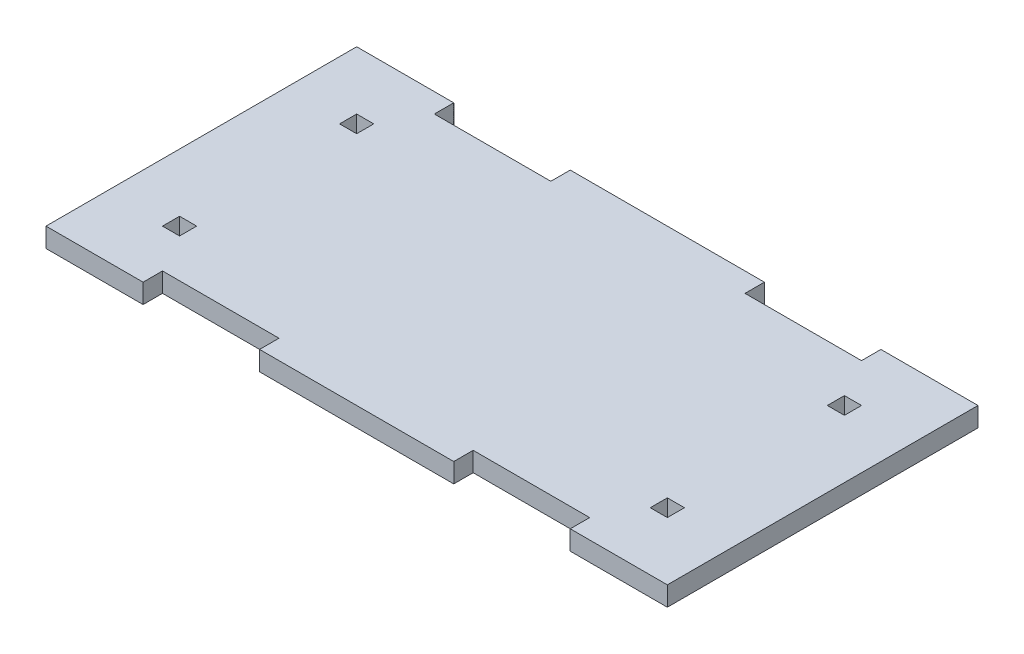
ISO-10303-21;
HEADER;
FILE_DESCRIPTION(('STEP AP214'),'2;1');
FILE_NAME('part.step','',(''),(''),'','','');
FILE_SCHEMA(('AUTOMOTIVE_DESIGN { 1 0 10303 214 1 1 1 1 }'));
ENDSEC;
DATA;
#1=APPLICATION_CONTEXT('core data for automotive mechanical design processes');
#2=APPLICATION_PROTOCOL_DEFINITION('international standard','automotive_design',2000,#1);
#3=PRODUCT_CONTEXT('',#1,'mechanical');
#4=PRODUCT('Part','Part','',(#3));
#5=PRODUCT_RELATED_PRODUCT_CATEGORY('part','',(#4));
#6=PRODUCT_DEFINITION_FORMATION('','',#4);
#7=PRODUCT_DEFINITION_CONTEXT('part definition',#1,'design');
#8=PRODUCT_DEFINITION('design','',#6,#7);
#9=PRODUCT_DEFINITION_SHAPE('','',#8);
#10=(LENGTH_UNIT() NAMED_UNIT(*) SI_UNIT(.MILLI.,.METRE.));
#11=(NAMED_UNIT(*) PLANE_ANGLE_UNIT() SI_UNIT($,.RADIAN.));
#12=(NAMED_UNIT(*) SI_UNIT($,.STERADIAN.) SOLID_ANGLE_UNIT());
#13=UNCERTAINTY_MEASURE_WITH_UNIT(LENGTH_MEASURE(1.E-05),#10,'distance_accuracy_value','');
#14=(GEOMETRIC_REPRESENTATION_CONTEXT(3) GLOBAL_UNCERTAINTY_ASSIGNED_CONTEXT((#13)) GLOBAL_UNIT_ASSIGNED_CONTEXT((#10,
#11,#12)) REPRESENTATION_CONTEXT('',''));
#15=CARTESIAN_POINT('',(0.,0.,0.));
#16=DIRECTION('',(0.,0.,1.));
#17=DIRECTION('',(1.,0.,0.));
#18=AXIS2_PLACEMENT_3D('',#15,#16,#17);
#19=CARTESIAN_POINT('',(0.,6.35,31.75));
#20=DIRECTION('',(0.,0.,1.));
#21=DIRECTION('',(1.,0.,0.));
#22=AXIS2_PLACEMENT_3D('',#19,#20,#21);
#23=PLANE('',#22);
#24=DIRECTION('',(-1.,0.,0.));
#25=VECTOR('',#24,1.);
#26=CARTESIAN_POINT('',(0.,0.,31.75));
#27=LINE('',#26,#25);
#28=CARTESIAN_POINT('',(82.55,0.,31.75));
#29=VERTEX_POINT('',#28);
#30=CARTESIAN_POINT('',(76.962,0.,31.75));
#31=VERTEX_POINT('',#30);
#32=EDGE_CURVE('E382',#29,#31,#27,.T.);
#33=ORIENTED_EDGE('',*,*,#32,.T.);
#34=DIRECTION('',(0.,-1.,0.));
#35=VECTOR('',#34,1.);
#36=CARTESIAN_POINT('',(76.962,6.35,31.75));
#37=LINE('',#36,#35);
#38=CARTESIAN_POINT('',(76.962,6.35,31.75));
#39=VERTEX_POINT('',#38);
#40=EDGE_CURVE('E11',#39,#31,#37,.T.);
#41=ORIENTED_EDGE('',*,*,#40,.F.);
#42=DIRECTION('',(-1.,0.,0.));
#43=VECTOR('',#42,1.);
#44=CARTESIAN_POINT('',(0.,6.35,31.75));
#45=LINE('',#44,#43);
#46=CARTESIAN_POINT('',(82.55,6.35,31.75));
#47=VERTEX_POINT('',#46);
#48=EDGE_CURVE('E282',#47,#39,#45,.T.);
#49=ORIENTED_EDGE('',*,*,#48,.F.);
#50=DIRECTION('',(0.,-1.,0.));
#51=VECTOR('',#50,1.);
#52=CARTESIAN_POINT('',(82.55,6.35,31.75));
#53=LINE('',#52,#51);
#54=EDGE_CURVE('E54',#47,#29,#53,.T.);
#55=ORIENTED_EDGE('',*,*,#54,.T.);
#56=EDGE_LOOP('',(#33,#41,#49,#55));
#57=FACE_BOUND('',#56,.T.);
#58=ADVANCED_FACE('F35',(#57),#23,.F.);
#59=CARTESIAN_POINT('',(76.962,6.35,0.));
#60=DIRECTION('',(-1.,0.,0.));
#61=DIRECTION('',(0.,0.,1.));
#62=AXIS2_PLACEMENT_3D('',#59,#60,#61);
#63=PLANE('',#62);
#64=DIRECTION('',(0.,0.,-1.));
#65=VECTOR('',#64,1.);
#66=CARTESIAN_POINT('',(76.962,0.,0.));
#67=LINE('',#66,#65);
#68=CARTESIAN_POINT('',(76.962,0.,26.162));
#69=VERTEX_POINT('',#68);
#70=EDGE_CURVE('E288',#31,#69,#67,.T.);
#71=ORIENTED_EDGE('',*,*,#70,.T.);
#72=DIRECTION('',(0.,-1.,0.));
#73=VECTOR('',#72,1.);
#74=CARTESIAN_POINT('',(76.962,6.35,26.162));
#75=LINE('',#74,#73);
#76=CARTESIAN_POINT('',(76.962,6.35,26.162));
#77=VERTEX_POINT('',#76);
#78=EDGE_CURVE('E45',#77,#69,#75,.T.);
#79=ORIENTED_EDGE('',*,*,#78,.F.);
#80=DIRECTION('',(0.,0.,-1.));
#81=VECTOR('',#80,1.);
#82=CARTESIAN_POINT('',(76.962,6.35,0.));
#83=LINE('',#82,#81);
#84=EDGE_CURVE('E276',#39,#77,#83,.T.);
#85=ORIENTED_EDGE('',*,*,#84,.F.);
#86=ORIENTED_EDGE('',*,*,#40,.T.);
#87=EDGE_LOOP('',(#71,#79,#85,#86));
#88=FACE_BOUND('',#87,.T.);
#89=ADVANCED_FACE('F287',(#88),#63,.F.);
#90=CARTESIAN_POINT('',(0.,6.35,26.162));
#91=DIRECTION('',(0.,0.,1.));
#92=DIRECTION('',(1.,0.,0.));
#93=AXIS2_PLACEMENT_3D('',#90,#91,#92);
#94=PLANE('',#93);
#95=DIRECTION('',(-1.,0.,0.));
#96=VECTOR('',#95,1.);
#97=CARTESIAN_POINT('',(0.,0.,26.162));
#98=LINE('',#97,#96);
#99=CARTESIAN_POINT('',(82.55,0.,26.162));
#100=VERTEX_POINT('',#99);
#101=EDGE_CURVE('E385',#100,#69,#98,.T.);
#102=ORIENTED_EDGE('',*,*,#101,.F.);
#103=DIRECTION('',(0.,-1.,0.));
#104=VECTOR('',#103,1.);
#105=CARTESIAN_POINT('',(82.55,6.35,26.162));
#106=LINE('',#105,#104);
#107=CARTESIAN_POINT('',(82.55,6.35,26.162));
#108=VERTEX_POINT('',#107);
#109=EDGE_CURVE('E164',#108,#100,#106,.T.);
#110=ORIENTED_EDGE('',*,*,#109,.F.);
#111=DIRECTION('',(-1.,0.,0.));
#112=VECTOR('',#111,1.);
#113=CARTESIAN_POINT('',(0.,6.35,26.162));
#114=LINE('',#113,#112);
#115=EDGE_CURVE('E281',#108,#77,#114,.T.);
#116=ORIENTED_EDGE('',*,*,#115,.T.);
#117=ORIENTED_EDGE('',*,*,#78,.T.);
#118=EDGE_LOOP('',(#102,#110,#116,#117));
#119=FACE_BOUND('',#118,.T.);
#120=ADVANCED_FACE('F292',(#119),#94,.T.);
#121=CARTESIAN_POINT('',(0.,6.35,-31.75));
#122=DIRECTION('',(0.,0.,-1.));
#123=DIRECTION('',(-1.,0.,0.));
#124=AXIS2_PLACEMENT_3D('',#121,#122,#123);
#125=PLANE('',#124);
#126=DIRECTION('',(1.,0.,0.));
#127=VECTOR('',#126,1.);
#128=CARTESIAN_POINT('',(0.,0.,-31.75));
#129=LINE('',#128,#127);
#130=CARTESIAN_POINT('',(76.962,0.,-31.75));
#131=VERTEX_POINT('',#130);
#132=CARTESIAN_POINT('',(82.55,0.,-31.75));
#133=VERTEX_POINT('',#132);
#134=EDGE_CURVE('E370',#131,#133,#129,.T.);
#135=ORIENTED_EDGE('',*,*,#134,.T.);
#136=DIRECTION('',(0.,-1.,0.));
#137=VECTOR('',#136,1.);
#138=CARTESIAN_POINT('',(82.55,6.35,-31.75));
#139=LINE('',#138,#137);
#140=CARTESIAN_POINT('',(82.55,6.35,-31.75));
#141=VERTEX_POINT('',#140);
#142=EDGE_CURVE('E392',#141,#133,#139,.T.);
#143=ORIENTED_EDGE('',*,*,#142,.F.);
#144=DIRECTION('',(1.,0.,0.));
#145=VECTOR('',#144,1.);
#146=CARTESIAN_POINT('',(0.,6.35,-31.75));
#147=LINE('',#146,#145);
#148=CARTESIAN_POINT('',(76.962,6.35,-31.75));
#149=VERTEX_POINT('',#148);
#150=EDGE_CURVE('E547',#149,#141,#147,.T.);
#151=ORIENTED_EDGE('',*,*,#150,.F.);
#152=DIRECTION('',(0.,-1.,0.));
#153=VECTOR('',#152,1.);
#154=CARTESIAN_POINT('',(76.962,6.35,-31.75));
#155=LINE('',#154,#153);
#156=EDGE_CURVE('E394',#149,#131,#155,.T.);
#157=ORIENTED_EDGE('',*,*,#156,.T.);
#158=EDGE_LOOP('',(#135,#143,#151,#157));
#159=FACE_BOUND('',#158,.T.);
#160=ADVANCED_FACE('F573',(#159),#125,.F.);
#161=CARTESIAN_POINT('',(82.55,6.35,0.));
#162=DIRECTION('',(1.,0.,0.));
#163=DIRECTION('',(0.,0.,-1.));
#164=AXIS2_PLACEMENT_3D('',#161,#162,#163);
#165=PLANE('',#164);
#166=DIRECTION('',(0.,0.,1.));
#167=VECTOR('',#166,1.);
#168=CARTESIAN_POINT('',(82.55,0.,0.));
#169=LINE('',#168,#167);
#170=CARTESIAN_POINT('',(82.55,0.,-26.162));
#171=VERTEX_POINT('',#170);
#172=EDGE_CURVE('E373',#133,#171,#169,.T.);
#173=ORIENTED_EDGE('',*,*,#172,.T.);
#174=DIRECTION('',(0.,-1.,0.));
#175=VECTOR('',#174,1.);
#176=CARTESIAN_POINT('',(82.55,6.35,-26.162));
#177=LINE('',#176,#175);
#178=CARTESIAN_POINT('',(82.55,6.35,-26.162));
#179=VERTEX_POINT('',#178);
#180=EDGE_CURVE('E399',#179,#171,#177,.T.);
#181=ORIENTED_EDGE('',*,*,#180,.F.);
#182=DIRECTION('',(0.,0.,1.));
#183=VECTOR('',#182,1.);
#184=CARTESIAN_POINT('',(82.55,6.35,0.));
#185=LINE('',#184,#183);
#186=EDGE_CURVE('E550',#141,#179,#185,.T.);
#187=ORIENTED_EDGE('',*,*,#186,.F.);
#188=ORIENTED_EDGE('',*,*,#142,.T.);
#189=EDGE_LOOP('',(#173,#181,#187,#188));
#190=FACE_BOUND('',#189,.T.);
#191=ADVANCED_FACE('F575',(#190),#165,.F.);
#192=CARTESIAN_POINT('',(0.,6.35,-26.162));
#193=DIRECTION('',(0.,0.,-1.));
#194=DIRECTION('',(-1.,0.,0.));
#195=AXIS2_PLACEMENT_3D('',#192,#193,#194);
#196=PLANE('',#195);
#197=DIRECTION('',(1.,0.,0.));
#198=VECTOR('',#197,1.);
#199=CARTESIAN_POINT('',(0.,0.,-26.162));
#200=LINE('',#199,#198);
#201=CARTESIAN_POINT('',(76.962,0.,-26.162));
#202=VERTEX_POINT('',#201);
#203=EDGE_CURVE('E376',#202,#171,#200,.T.);
#204=ORIENTED_EDGE('',*,*,#203,.F.);
#205=DIRECTION('',(0.,-1.,0.));
#206=VECTOR('',#205,1.);
#207=CARTESIAN_POINT('',(76.962,6.35,-26.162));
#208=LINE('',#207,#206);
#209=CARTESIAN_POINT('',(76.962,6.35,-26.162));
#210=VERTEX_POINT('',#209);
#211=EDGE_CURVE('E396',#210,#202,#208,.T.);
#212=ORIENTED_EDGE('',*,*,#211,.F.);
#213=DIRECTION('',(1.,0.,0.));
#214=VECTOR('',#213,1.);
#215=CARTESIAN_POINT('',(0.,6.35,-26.162));
#216=LINE('',#215,#214);
#217=EDGE_CURVE('E552',#210,#179,#216,.T.);
#218=ORIENTED_EDGE('',*,*,#217,.T.);
#219=ORIENTED_EDGE('',*,*,#180,.T.);
#220=EDGE_LOOP('',(#204,#212,#218,#219));
#221=FACE_BOUND('',#220,.T.);
#222=ADVANCED_FACE('F568',(#221),#196,.T.);
#223=CARTESIAN_POINT('',(0.,6.35,-31.75));
#224=DIRECTION('',(0.,0.,-1.));
#225=DIRECTION('',(-1.,0.,0.));
#226=AXIS2_PLACEMENT_3D('',#223,#224,#225);
#227=PLANE('',#226);
#228=DIRECTION('',(1.,0.,0.));
#229=VECTOR('',#228,1.);
#230=CARTESIAN_POINT('',(0.,0.,-31.75));
#231=LINE('',#230,#229);
#232=CARTESIAN_POINT('',(-82.55,0.,-31.75));
#233=VERTEX_POINT('',#232);
#234=CARTESIAN_POINT('',(-76.962,0.,-31.75));
#235=VERTEX_POINT('',#234);
#236=EDGE_CURVE('E358',#233,#235,#231,.T.);
#237=ORIENTED_EDGE('',*,*,#236,.T.);
#238=DIRECTION('',(0.,-1.,0.));
#239=VECTOR('',#238,1.);
#240=CARTESIAN_POINT('',(-76.962,6.35,-31.75));
#241=LINE('',#240,#239);
#242=CARTESIAN_POINT('',(-76.962,6.35,-31.75));
#243=VERTEX_POINT('',#242);
#244=EDGE_CURVE('E397',#243,#235,#241,.T.);
#245=ORIENTED_EDGE('',*,*,#244,.F.);
#246=DIRECTION('',(1.,0.,0.));
#247=VECTOR('',#246,1.);
#248=CARTESIAN_POINT('',(0.,6.35,-31.75));
#249=LINE('',#248,#247);
#250=CARTESIAN_POINT('',(-82.55,6.35,-31.75));
#251=VERTEX_POINT('',#250);
#252=EDGE_CURVE('E536',#251,#243,#249,.T.);
#253=ORIENTED_EDGE('',*,*,#252,.F.);
#254=DIRECTION('',(0.,-1.,0.));
#255=VECTOR('',#254,1.);
#256=CARTESIAN_POINT('',(-82.55,6.35,-31.75));
#257=LINE('',#256,#255);
#258=EDGE_CURVE('E403',#251,#233,#257,.T.);
#259=ORIENTED_EDGE('',*,*,#258,.T.);
#260=EDGE_LOOP('',(#237,#245,#253,#259));
#261=FACE_BOUND('',#260,.T.);
#262=ADVANCED_FACE('F582',(#261),#227,.F.);
#263=CARTESIAN_POINT('',(-76.962,6.35,0.));
#264=DIRECTION('',(1.,0.,0.));
#265=DIRECTION('',(0.,0.,-1.));
#266=AXIS2_PLACEMENT_3D('',#263,#264,#265);
#267=PLANE('',#266);
#268=DIRECTION('',(0.,0.,1.));
#269=VECTOR('',#268,1.);
#270=CARTESIAN_POINT('',(-76.962,0.,0.));
#271=LINE('',#270,#269);
#272=CARTESIAN_POINT('',(-76.962,0.,-26.162));
#273=VERTEX_POINT('',#272);
#274=EDGE_CURVE('E361',#235,#273,#271,.T.);
#275=ORIENTED_EDGE('',*,*,#274,.T.);
#276=DIRECTION('',(0.,-1.,0.));
#277=VECTOR('',#276,1.);
#278=CARTESIAN_POINT('',(-76.962,6.35,-26.162));
#279=LINE('',#278,#277);
#280=CARTESIAN_POINT('',(-76.962,6.35,-26.162));
#281=VERTEX_POINT('',#280);
#282=EDGE_CURVE('E408',#281,#273,#279,.T.);
#283=ORIENTED_EDGE('',*,*,#282,.F.);
#284=DIRECTION('',(0.,0.,1.));
#285=VECTOR('',#284,1.);
#286=CARTESIAN_POINT('',(-76.962,6.35,0.));
#287=LINE('',#286,#285);
#288=EDGE_CURVE('E539',#243,#281,#287,.T.);
#289=ORIENTED_EDGE('',*,*,#288,.F.);
#290=ORIENTED_EDGE('',*,*,#244,.T.);
#291=EDGE_LOOP('',(#275,#283,#289,#290));
#292=FACE_BOUND('',#291,.T.);
#293=ADVANCED_FACE('F856',(#292),#267,.F.);
#294=CARTESIAN_POINT('',(0.,6.35,-26.162));
#295=DIRECTION('',(0.,0.,-1.));
#296=DIRECTION('',(-1.,0.,0.));
#297=AXIS2_PLACEMENT_3D('',#294,#295,#296);
#298=PLANE('',#297);
#299=DIRECTION('',(1.,0.,0.));
#300=VECTOR('',#299,1.);
#301=CARTESIAN_POINT('',(0.,0.,-26.162));
#302=LINE('',#301,#300);
#303=CARTESIAN_POINT('',(-82.55,0.,-26.162));
#304=VERTEX_POINT('',#303);
#305=EDGE_CURVE('E364',#304,#273,#302,.T.);
#306=ORIENTED_EDGE('',*,*,#305,.F.);
#307=DIRECTION('',(0.,-1.,0.));
#308=VECTOR('',#307,1.);
#309=CARTESIAN_POINT('',(-82.55,6.35,-26.162));
#310=LINE('',#309,#308);
#311=CARTESIAN_POINT('',(-82.55,6.35,-26.162));
#312=VERTEX_POINT('',#311);
#313=EDGE_CURVE('E405',#312,#304,#310,.T.);
#314=ORIENTED_EDGE('',*,*,#313,.F.);
#315=DIRECTION('',(1.,0.,0.));
#316=VECTOR('',#315,1.);
#317=CARTESIAN_POINT('',(0.,6.35,-26.162));
#318=LINE('',#317,#316);
#319=EDGE_CURVE('E541',#312,#281,#318,.T.);
#320=ORIENTED_EDGE('',*,*,#319,.T.);
#321=ORIENTED_EDGE('',*,*,#282,.T.);
#322=EDGE_LOOP('',(#306,#314,#320,#321));
#323=FACE_BOUND('',#322,.T.);
#324=ADVANCED_FACE('F866',(#323),#298,.T.);
#325=CARTESIAN_POINT('',(0.,6.35,26.162));
#326=DIRECTION('',(0.,0.,-1.));
#327=DIRECTION('',(-1.,0.,0.));
#328=AXIS2_PLACEMENT_3D('',#325,#326,#327);
#329=PLANE('',#328);
#330=DIRECTION('',(1.,0.,0.));
#331=VECTOR('',#330,1.);
#332=CARTESIAN_POINT('',(0.,0.,26.162));
#333=LINE('',#332,#331);
#334=CARTESIAN_POINT('',(-82.55,0.,26.162));
#335=VERTEX_POINT('',#334);
#336=CARTESIAN_POINT('',(-76.962,0.,26.162));
#337=VERTEX_POINT('',#336);
#338=EDGE_CURVE('E346',#335,#337,#333,.T.);
#339=ORIENTED_EDGE('',*,*,#338,.T.);
#340=DIRECTION('',(0.,-1.,0.));
#341=VECTOR('',#340,1.);
#342=CARTESIAN_POINT('',(-76.962,6.35,26.162));
#343=LINE('',#342,#341);
#344=CARTESIAN_POINT('',(-76.962,6.35,26.162));
#345=VERTEX_POINT('',#344);
#346=EDGE_CURVE('E406',#345,#337,#343,.T.);
#347=ORIENTED_EDGE('',*,*,#346,.F.);
#348=DIRECTION('',(1.,0.,0.));
#349=VECTOR('',#348,1.);
#350=CARTESIAN_POINT('',(0.,6.35,26.162));
#351=LINE('',#350,#349);
#352=CARTESIAN_POINT('',(-82.55,6.35,26.162));
#353=VERTEX_POINT('',#352);
#354=EDGE_CURVE('E525',#353,#345,#351,.T.);
#355=ORIENTED_EDGE('',*,*,#354,.F.);
#356=DIRECTION('',(0.,-1.,0.));
#357=VECTOR('',#356,1.);
#358=CARTESIAN_POINT('',(-82.55,6.35,26.162));
#359=LINE('',#358,#357);
#360=EDGE_CURVE('E412',#353,#335,#359,.T.);
#361=ORIENTED_EDGE('',*,*,#360,.T.);
#362=EDGE_LOOP('',(#339,#347,#355,#361));
#363=FACE_BOUND('',#362,.T.);
#364=ADVANCED_FACE('F876',(#363),#329,.F.);
#365=CARTESIAN_POINT('',(-76.9620000000001,6.35,1.91134986625808E-13));
#366=DIRECTION('',(1.,0.,0.));
#367=DIRECTION('',(0.,0.,-1.));
#368=AXIS2_PLACEMENT_3D('',#365,#366,#367);
#369=PLANE('',#368);
#370=DIRECTION('',(0.,0.,1.));
#371=VECTOR('',#370,1.);
#372=CARTESIAN_POINT('',(-76.9620000000001,0.,1.91134986625808E-13));
#373=LINE('',#372,#371);
#374=CARTESIAN_POINT('',(-76.962,0.,31.75));
#375=VERTEX_POINT('',#374);
#376=EDGE_CURVE('E349',#337,#375,#373,.T.);
#377=ORIENTED_EDGE('',*,*,#376,.T.);
#378=DIRECTION('',(0.,-1.,0.));
#379=VECTOR('',#378,1.);
#380=CARTESIAN_POINT('',(-76.962,6.35,31.75));
#381=LINE('',#380,#379);
#382=CARTESIAN_POINT('',(-76.962,6.35,31.75));
#383=VERTEX_POINT('',#382);
#384=EDGE_CURVE('E416',#383,#375,#381,.T.);
#385=ORIENTED_EDGE('',*,*,#384,.F.);
#386=DIRECTION('',(0.,0.,1.));
#387=VECTOR('',#386,1.);
#388=CARTESIAN_POINT('',(-76.9620000000001,6.35,1.91134986625808E-13));
#389=LINE('',#388,#387);
#390=EDGE_CURVE('E528',#345,#383,#389,.T.);
#391=ORIENTED_EDGE('',*,*,#390,.F.);
#392=ORIENTED_EDGE('',*,*,#346,.T.);
#393=EDGE_LOOP('',(#377,#385,#391,#392));
#394=FACE_BOUND('',#393,.T.);
#395=ADVANCED_FACE('F886',(#394),#369,.F.);
#396=CARTESIAN_POINT('',(0.,6.35,31.75));
#397=DIRECTION('',(0.,0.,-1.));
#398=DIRECTION('',(-1.,0.,0.));
#399=AXIS2_PLACEMENT_3D('',#396,#397,#398);
#400=PLANE('',#399);
#401=DIRECTION('',(1.,0.,0.));
#402=VECTOR('',#401,1.);
#403=CARTESIAN_POINT('',(0.,0.,31.75));
#404=LINE('',#403,#402);
#405=CARTESIAN_POINT('',(-82.55,0.,31.75));
#406=VERTEX_POINT('',#405);
#407=EDGE_CURVE('E352',#406,#375,#404,.T.);
#408=ORIENTED_EDGE('',*,*,#407,.F.);
#409=DIRECTION('',(0.,-1.,0.));
#410=VECTOR('',#409,1.);
#411=CARTESIAN_POINT('',(-82.55,6.35,31.75));
#412=LINE('',#411,#410);
#413=CARTESIAN_POINT('',(-82.55,6.35,31.75));
#414=VERTEX_POINT('',#413);
#415=EDGE_CURVE('E414',#414,#406,#412,.T.);
#416=ORIENTED_EDGE('',*,*,#415,.F.);
#417=DIRECTION('',(1.,0.,0.));
#418=VECTOR('',#417,1.);
#419=CARTESIAN_POINT('',(0.,6.35,31.75));
#420=LINE('',#419,#418);
#421=EDGE_CURVE('E530',#414,#383,#420,.T.);
#422=ORIENTED_EDGE('',*,*,#421,.T.);
#423=ORIENTED_EDGE('',*,*,#384,.T.);
#424=EDGE_LOOP('',(#408,#416,#422,#423));
#425=FACE_BOUND('',#424,.T.);
#426=ADVANCED_FACE('F668',(#425),#400,.T.);
#427=CARTESIAN_POINT('',(-69.85,6.35,0.));
#428=DIRECTION('',(1.,0.,0.));
#429=DIRECTION('',(0.,0.,-1.));
#430=AXIS2_PLACEMENT_3D('',#427,#428,#429);
#431=PLANE('',#430);
#432=DIRECTION('',(0.,0.,1.));
#433=VECTOR('',#432,1.);
#434=CARTESIAN_POINT('',(-69.85,0.,0.));
#435=LINE('',#434,#433);
#436=CARTESIAN_POINT('',(-69.85,0.,-50.8));
#437=VERTEX_POINT('',#436);
#438=CARTESIAN_POINT('',(-69.85,0.,-44.45));
#439=VERTEX_POINT('',#438);
#440=EDGE_CURVE('E299',#437,#439,#435,.T.);
#441=ORIENTED_EDGE('',*,*,#440,.F.);
#442=DIRECTION('',(0.,-1.,0.));
#443=VECTOR('',#442,1.);
#444=CARTESIAN_POINT('',(-69.85,6.35,-50.8));
#445=LINE('',#444,#443);
#446=CARTESIAN_POINT('',(-69.85,6.35,-50.8));
#447=VERTEX_POINT('',#446);
#448=EDGE_CURVE('E39',#447,#437,#445,.T.);
#449=ORIENTED_EDGE('',*,*,#448,.F.);
#450=DIRECTION('',(0.,0.,1.));
#451=VECTOR('',#450,1.);
#452=CARTESIAN_POINT('',(-69.85,6.35,0.));
#453=LINE('',#452,#451);
#454=CARTESIAN_POINT('',(-69.85,6.35,-44.45));
#455=VERTEX_POINT('',#454);
#456=EDGE_CURVE('E390',#447,#455,#453,.T.);
#457=ORIENTED_EDGE('',*,*,#456,.T.);
#458=DIRECTION('',(0.,-1.,0.));
#459=VECTOR('',#458,1.);
#460=CARTESIAN_POINT('',(-69.85,6.35,-44.45));
#461=LINE('',#460,#459);
#462=EDGE_CURVE('E295',#455,#439,#461,.T.);
#463=ORIENTED_EDGE('',*,*,#462,.T.);
#464=EDGE_LOOP('',(#441,#449,#457,#463));
#465=FACE_BOUND('',#464,.T.);
#466=ADVANCED_FACE('F37',(#465),#431,.T.);
#467=CARTESIAN_POINT('',(0.,6.35,-50.8));
#468=DIRECTION('',(0.,0.,-1.));
#469=DIRECTION('',(-1.,0.,0.));
#470=AXIS2_PLACEMENT_3D('',#467,#468,#469);
#471=PLANE('',#470);
#472=DIRECTION('',(1.,0.,0.));
#473=VECTOR('',#472,1.);
#474=CARTESIAN_POINT('',(0.,0.,-50.8));
#475=LINE('',#474,#473);
#476=CARTESIAN_POINT('',(-101.6,0.,-50.8));
#477=VERTEX_POINT('',#476);
#478=EDGE_CURVE('E302',#477,#437,#475,.T.);
#479=ORIENTED_EDGE('',*,*,#478,.F.);
#480=DIRECTION('',(0.,-1.,0.));
#481=VECTOR('',#480,1.);
#482=CARTESIAN_POINT('',(-101.6,6.35,-50.8));
#483=LINE('',#482,#481);
#484=CARTESIAN_POINT('',(-101.6,6.35,-50.8));
#485=VERTEX_POINT('',#484);
#486=EDGE_CURVE('E461',#485,#477,#483,.T.);
#487=ORIENTED_EDGE('',*,*,#486,.F.);
#488=DIRECTION('',(1.,0.,0.));
#489=VECTOR('',#488,1.);
#490=CARTESIAN_POINT('',(0.,6.35,-50.8));
#491=LINE('',#490,#489);
#492=EDGE_CURVE('E470',#485,#447,#491,.T.);
#493=ORIENTED_EDGE('',*,*,#492,.T.);
#494=ORIENTED_EDGE('',*,*,#448,.T.);
#495=EDGE_LOOP('',(#479,#487,#493,#494));
#496=FACE_BOUND('',#495,.T.);
#497=ADVANCED_FACE('F468',(#496),#471,.T.);
#498=CARTESIAN_POINT('',(-101.6,6.35,0.));
#499=DIRECTION('',(-1.,0.,0.));
#500=DIRECTION('',(0.,0.,1.));
#501=AXIS2_PLACEMENT_3D('',#498,#499,#500);
#502=PLANE('',#501);
#503=DIRECTION('',(0.,0.,-1.));
#504=VECTOR('',#503,1.);
#505=CARTESIAN_POINT('',(-101.6,0.,0.));
#506=LINE('',#505,#504);
#507=CARTESIAN_POINT('',(-101.6,0.,50.8));
#508=VERTEX_POINT('',#507);
#509=EDGE_CURVE('E305',#508,#477,#506,.T.);
#510=ORIENTED_EDGE('',*,*,#509,.F.);
#511=DIRECTION('',(0.,-1.,0.));
#512=VECTOR('',#511,1.);
#513=CARTESIAN_POINT('',(-101.6,6.35,50.8));
#514=LINE('',#513,#512);
#515=CARTESIAN_POINT('',(-101.6,6.35,50.8));
#516=VERTEX_POINT('',#515);
#517=EDGE_CURVE('E460',#516,#508,#514,.T.);
#518=ORIENTED_EDGE('',*,*,#517,.F.);
#519=DIRECTION('',(0.,0.,-1.));
#520=VECTOR('',#519,1.);
#521=CARTESIAN_POINT('',(-101.6,6.35,0.));
#522=LINE('',#521,#520);
#523=EDGE_CURVE('E481',#516,#485,#522,.T.);
#524=ORIENTED_EDGE('',*,*,#523,.T.);
#525=ORIENTED_EDGE('',*,*,#486,.T.);
#526=EDGE_LOOP('',(#510,#518,#524,#525));
#527=FACE_BOUND('',#526,.T.);
#528=ADVANCED_FACE('F478',(#527),#502,.T.);
#529=CARTESIAN_POINT('',(0.,6.35,50.8));
#530=DIRECTION('',(0.,0.,-1.));
#531=DIRECTION('',(-1.,0.,0.));
#532=AXIS2_PLACEMENT_3D('',#529,#530,#531);
#533=PLANE('',#532);
#534=DIRECTION('',(1.,0.,0.));
#535=VECTOR('',#534,1.);
#536=CARTESIAN_POINT('',(0.,0.,50.8));
#537=LINE('',#536,#535);
#538=CARTESIAN_POINT('',(-69.85,0.,50.8));
#539=VERTEX_POINT('',#538);
#540=EDGE_CURVE('E310',#508,#539,#537,.T.);
#541=ORIENTED_EDGE('',*,*,#540,.T.);
#542=DIRECTION('',(0.,-1.,0.));
#543=VECTOR('',#542,1.);
#544=CARTESIAN_POINT('',(-69.85,6.35,50.8));
#545=LINE('',#544,#543);
#546=CARTESIAN_POINT('',(-69.85,6.35,50.8));
#547=VERTEX_POINT('',#546);
#548=EDGE_CURVE('E457',#547,#539,#545,.T.);
#549=ORIENTED_EDGE('',*,*,#548,.F.);
#550=DIRECTION('',(1.,0.,0.));
#551=VECTOR('',#550,1.);
#552=CARTESIAN_POINT('',(0.,6.35,50.8));
#553=LINE('',#552,#551);
#554=EDGE_CURVE('E484',#516,#547,#553,.T.);
#555=ORIENTED_EDGE('',*,*,#554,.F.);
#556=ORIENTED_EDGE('',*,*,#517,.T.);
#557=EDGE_LOOP('',(#541,#549,#555,#556));
#558=FACE_BOUND('',#557,.T.);
#559=ADVANCED_FACE('F485',(#558),#533,.F.);
#560=CARTESIAN_POINT('',(-69.85,6.35,0.));
#561=DIRECTION('',(-1.,0.,0.));
#562=DIRECTION('',(0.,0.,1.));
#563=AXIS2_PLACEMENT_3D('',#560,#561,#562);
#564=PLANE('',#563);
#565=DIRECTION('',(0.,0.,-1.));
#566=VECTOR('',#565,1.);
#567=CARTESIAN_POINT('',(-69.85,0.,0.));
#568=LINE('',#567,#566);
#569=CARTESIAN_POINT('',(-69.85,0.,44.45));
#570=VERTEX_POINT('',#569);
#571=EDGE_CURVE('E312',#539,#570,#568,.T.);
#572=ORIENTED_EDGE('',*,*,#571,.T.);
#573=DIRECTION('',(0.,-1.,0.));
#574=VECTOR('',#573,1.);
#575=CARTESIAN_POINT('',(-69.85,6.35,44.45));
#576=LINE('',#575,#574);
#577=CARTESIAN_POINT('',(-69.85,6.35,44.45));
#578=VERTEX_POINT('',#577);
#579=EDGE_CURVE('E454',#578,#570,#576,.T.);
#580=ORIENTED_EDGE('',*,*,#579,.F.);
#581=DIRECTION('',(0.,0.,-1.));
#582=VECTOR('',#581,1.);
#583=CARTESIAN_POINT('',(-69.85,6.35,0.));
#584=LINE('',#583,#582);
#585=EDGE_CURVE('E488',#547,#578,#584,.T.);
#586=ORIENTED_EDGE('',*,*,#585,.F.);
#587=ORIENTED_EDGE('',*,*,#548,.T.);
#588=EDGE_LOOP('',(#572,#580,#586,#587));
#589=FACE_BOUND('',#588,.T.);
#590=ADVANCED_FACE('F656',(#589),#564,.F.);
#591=CARTESIAN_POINT('',(0.,6.35,44.45));
#592=DIRECTION('',(0.,0.,-1.));
#593=DIRECTION('',(-1.,0.,0.));
#594=AXIS2_PLACEMENT_3D('',#591,#592,#593);
#595=PLANE('',#594);
#596=DIRECTION('',(1.,0.,0.));
#597=VECTOR('',#596,1.);
#598=CARTESIAN_POINT('',(0.,0.,44.45));
#599=LINE('',#598,#597);
#600=CARTESIAN_POINT('',(-31.75,0.,44.45));
#601=VERTEX_POINT('',#600);
#602=EDGE_CURVE('E316',#570,#601,#599,.T.);
#603=ORIENTED_EDGE('',*,*,#602,.T.);
#604=DIRECTION('',(0.,-1.,0.));
#605=VECTOR('',#604,1.);
#606=CARTESIAN_POINT('',(-31.75,6.35,44.45));
#607=LINE('',#606,#605);
#608=CARTESIAN_POINT('',(-31.75,6.35,44.45));
#609=VERTEX_POINT('',#608);
#610=EDGE_CURVE('E452',#609,#601,#607,.T.);
#611=ORIENTED_EDGE('',*,*,#610,.F.);
#612=DIRECTION('',(1.,0.,0.));
#613=VECTOR('',#612,1.);
#614=CARTESIAN_POINT('',(0.,6.35,44.45));
#615=LINE('',#614,#613);
#616=EDGE_CURVE('E500',#578,#609,#615,.T.);
#617=ORIENTED_EDGE('',*,*,#616,.F.);
#618=ORIENTED_EDGE('',*,*,#579,.T.);
#619=EDGE_LOOP('',(#603,#611,#617,#618));
#620=FACE_BOUND('',#619,.T.);
#621=ADVANCED_FACE('F652',(#620),#595,.F.);
#622=CARTESIAN_POINT('',(-31.75,6.35,0.));
#623=DIRECTION('',(-1.,0.,0.));
#624=DIRECTION('',(0.,0.,1.));
#625=AXIS2_PLACEMENT_3D('',#622,#623,#624);
#626=PLANE('',#625);
#627=DIRECTION('',(0.,0.,-1.));
#628=VECTOR('',#627,1.);
#629=CARTESIAN_POINT('',(-31.75,0.,0.));
#630=LINE('',#629,#628);
#631=CARTESIAN_POINT('',(-31.75,0.,50.8));
#632=VERTEX_POINT('',#631);
#633=EDGE_CURVE('E319',#632,#601,#630,.T.);
#634=ORIENTED_EDGE('',*,*,#633,.F.);
#635=DIRECTION('',(0.,-1.,0.));
#636=VECTOR('',#635,1.);
#637=CARTESIAN_POINT('',(-31.75,6.35,50.8));
#638=LINE('',#637,#636);
#639=CARTESIAN_POINT('',(-31.75,6.35,50.8));
#640=VERTEX_POINT('',#639);
#641=EDGE_CURVE('E450',#640,#632,#638,.T.);
#642=ORIENTED_EDGE('',*,*,#641,.F.);
#643=DIRECTION('',(0.,0.,-1.));
#644=VECTOR('',#643,1.);
#645=CARTESIAN_POINT('',(-31.75,6.35,0.));
#646=LINE('',#645,#644);
#647=EDGE_CURVE('E502',#640,#609,#646,.T.);
#648=ORIENTED_EDGE('',*,*,#647,.T.);
#649=ORIENTED_EDGE('',*,*,#610,.T.);
#650=EDGE_LOOP('',(#634,#642,#648,#649));
#651=FACE_BOUND('',#650,.T.);
#652=ADVANCED_FACE('F649',(#651),#626,.T.);
#653=CARTESIAN_POINT('',(31.75,0.,50.8));
#654=VERTEX_POINT('',#653);
#655=EDGE_CURVE('E314',#632,#654,#537,.T.);
#656=ORIENTED_EDGE('',*,*,#655,.T.);
#657=DIRECTION('',(0.,-1.,0.));
#658=VECTOR('',#657,1.);
#659=CARTESIAN_POINT('',(31.75,6.35,50.8));
#660=LINE('',#659,#658);
#661=CARTESIAN_POINT('',(31.75,6.35,50.8));
#662=VERTEX_POINT('',#661);
#663=EDGE_CURVE('E447',#662,#654,#660,.T.);
#664=ORIENTED_EDGE('',*,*,#663,.F.);
#665=EDGE_CURVE('E491',#640,#662,#553,.T.);
#666=ORIENTED_EDGE('',*,*,#665,.F.);
#667=ORIENTED_EDGE('',*,*,#641,.T.);
#668=EDGE_LOOP('',(#656,#664,#666,#667));
#669=FACE_BOUND('',#668,.T.);
#670=ADVANCED_FACE('F637',(#669),#533,.F.);
#671=CARTESIAN_POINT('',(31.75,6.35,0.));
#672=DIRECTION('',(-1.,0.,0.));
#673=DIRECTION('',(0.,0.,1.));
#674=AXIS2_PLACEMENT_3D('',#671,#672,#673);
#675=PLANE('',#674);
#676=DIRECTION('',(0.,0.,-1.));
#677=VECTOR('',#676,1.);
#678=CARTESIAN_POINT('',(31.75,0.,0.));
#679=LINE('',#678,#677);
#680=CARTESIAN_POINT('',(31.75,0.,44.45));
#681=VERTEX_POINT('',#680);
#682=EDGE_CURVE('E322',#654,#681,#679,.T.);
#683=ORIENTED_EDGE('',*,*,#682,.T.);
#684=DIRECTION('',(0.,-1.,0.));
#685=VECTOR('',#684,1.);
#686=CARTESIAN_POINT('',(31.75,6.35,44.45));
#687=LINE('',#686,#685);
#688=CARTESIAN_POINT('',(31.75,6.35,44.45));
#689=VERTEX_POINT('',#688);
#690=EDGE_CURVE('E444',#689,#681,#687,.T.);
#691=ORIENTED_EDGE('',*,*,#690,.F.);
#692=DIRECTION('',(0.,0.,-1.));
#693=VECTOR('',#692,1.);
#694=CARTESIAN_POINT('',(31.75,6.35,0.));
#695=LINE('',#694,#693);
#696=EDGE_CURVE('E505',#662,#689,#695,.T.);
#697=ORIENTED_EDGE('',*,*,#696,.F.);
#698=ORIENTED_EDGE('',*,*,#663,.T.);
#699=EDGE_LOOP('',(#683,#691,#697,#698));
#700=FACE_BOUND('',#699,.T.);
#701=ADVANCED_FACE('F644',(#700),#675,.F.);
#702=CARTESIAN_POINT('',(0.,6.35,44.45));
#703=DIRECTION('',(0.,0.,-1.));
#704=DIRECTION('',(-1.,0.,0.));
#705=AXIS2_PLACEMENT_3D('',#702,#703,#704);
#706=PLANE('',#705);
#707=DIRECTION('',(1.,0.,0.));
#708=VECTOR('',#707,1.);
#709=CARTESIAN_POINT('',(0.,0.,44.45));
#710=LINE('',#709,#708);
#711=CARTESIAN_POINT('',(69.85,0.,44.45));
#712=VERTEX_POINT('',#711);
#713=EDGE_CURVE('E324',#681,#712,#710,.T.);
#714=ORIENTED_EDGE('',*,*,#713,.T.);
#715=DIRECTION('',(0.,-1.,0.));
#716=VECTOR('',#715,1.);
#717=CARTESIAN_POINT('',(69.85,6.35,44.45));
#718=LINE('',#717,#716);
#719=CARTESIAN_POINT('',(69.85,6.35,44.45));
#720=VERTEX_POINT('',#719);
#721=EDGE_CURVE('E442',#720,#712,#718,.T.);
#722=ORIENTED_EDGE('',*,*,#721,.F.);
#723=DIRECTION('',(1.,0.,0.));
#724=VECTOR('',#723,1.);
#725=CARTESIAN_POINT('',(0.,6.35,44.45));
#726=LINE('',#725,#724);
#727=EDGE_CURVE('E507',#689,#720,#726,.T.);
#728=ORIENTED_EDGE('',*,*,#727,.F.);
#729=ORIENTED_EDGE('',*,*,#690,.T.);
#730=EDGE_LOOP('',(#714,#722,#728,#729));
#731=FACE_BOUND('',#730,.T.);
#732=ADVANCED_FACE('F640',(#731),#706,.F.);
#733=CARTESIAN_POINT('',(69.85,6.35,0.));
#734=DIRECTION('',(-1.,0.,0.));
#735=DIRECTION('',(0.,0.,1.));
#736=AXIS2_PLACEMENT_3D('',#733,#734,#735);
#737=PLANE('',#736);
#738=DIRECTION('',(0.,0.,-1.));
#739=VECTOR('',#738,1.);
#740=CARTESIAN_POINT('',(69.85,0.,0.));
#741=LINE('',#740,#739);
#742=CARTESIAN_POINT('',(69.85,0.,50.8));
#743=VERTEX_POINT('',#742);
#744=EDGE_CURVE('E327',#743,#712,#741,.T.);
#745=ORIENTED_EDGE('',*,*,#744,.F.);
#746=DIRECTION('',(0.,-1.,0.));
#747=VECTOR('',#746,1.);
#748=CARTESIAN_POINT('',(69.85,6.35,50.8));
#749=LINE('',#748,#747);
#750=CARTESIAN_POINT('',(69.85,6.35,50.8));
#751=VERTEX_POINT('',#750);
#752=EDGE_CURVE('E440',#751,#743,#749,.T.);
#753=ORIENTED_EDGE('',*,*,#752,.F.);
#754=DIRECTION('',(0.,0.,-1.));
#755=VECTOR('',#754,1.);
#756=CARTESIAN_POINT('',(69.85,6.35,0.));
#757=LINE('',#756,#755);
#758=EDGE_CURVE('E509',#751,#720,#757,.T.);
#759=ORIENTED_EDGE('',*,*,#758,.T.);
#760=ORIENTED_EDGE('',*,*,#721,.T.);
#761=EDGE_LOOP('',(#745,#753,#759,#760));
#762=FACE_BOUND('',#761,.T.);
#763=ADVANCED_FACE('F635',(#762),#737,.T.);
#764=CARTESIAN_POINT('',(101.6,0.,50.8));
#765=VERTEX_POINT('',#764);
#766=EDGE_CURVE('E313',#743,#765,#537,.T.);
#767=ORIENTED_EDGE('',*,*,#766,.T.);
#768=DIRECTION('',(0.,-1.,0.));
#769=VECTOR('',#768,1.);
#770=CARTESIAN_POINT('',(101.6,6.35,50.8));
#771=LINE('',#770,#769);
#772=CARTESIAN_POINT('',(101.6,6.35,50.8));
#773=VERTEX_POINT('',#772);
#774=EDGE_CURVE('E437',#773,#765,#771,.T.);
#775=ORIENTED_EDGE('',*,*,#774,.F.);
#776=EDGE_CURVE('E490',#751,#773,#553,.T.);
#777=ORIENTED_EDGE('',*,*,#776,.F.);
#778=ORIENTED_EDGE('',*,*,#752,.T.);
#779=EDGE_LOOP('',(#767,#775,#777,#778));
#780=FACE_BOUND('',#779,.T.);
#781=ADVANCED_FACE('F631',(#780),#533,.F.);
#782=CARTESIAN_POINT('',(101.6,6.35,0.));
#783=DIRECTION('',(-1.,0.,0.));
#784=DIRECTION('',(0.,0.,1.));
#785=AXIS2_PLACEMENT_3D('',#782,#783,#784);
#786=PLANE('',#785);
#787=DIRECTION('',(0.,0.,-1.));
#788=VECTOR('',#787,1.);
#789=CARTESIAN_POINT('',(101.6,0.,0.));
#790=LINE('',#789,#788);
#791=CARTESIAN_POINT('',(101.6,0.,-50.8));
#792=VERTEX_POINT('',#791);
#793=EDGE_CURVE('E330',#765,#792,#790,.T.);
#794=ORIENTED_EDGE('',*,*,#793,.T.);
#795=DIRECTION('',(0.,-1.,0.));
#796=VECTOR('',#795,1.);
#797=CARTESIAN_POINT('',(101.6,6.35,-50.8));
#798=LINE('',#797,#796);
#799=CARTESIAN_POINT('',(101.6,6.35,-50.8));
#800=VERTEX_POINT('',#799);
#801=EDGE_CURVE('E435',#800,#792,#798,.T.);
#802=ORIENTED_EDGE('',*,*,#801,.F.);
#803=DIRECTION('',(0.,0.,-1.));
#804=VECTOR('',#803,1.);
#805=CARTESIAN_POINT('',(101.6,6.35,0.));
#806=LINE('',#805,#804);
#807=EDGE_CURVE('E512',#773,#800,#806,.T.);
#808=ORIENTED_EDGE('',*,*,#807,.F.);
#809=ORIENTED_EDGE('',*,*,#774,.T.);
#810=EDGE_LOOP('',(#794,#802,#808,#809));
#811=FACE_BOUND('',#810,.T.);
#812=ADVANCED_FACE('F628',(#811),#786,.F.);
#813=CARTESIAN_POINT('',(69.85,0.,-50.8));
#814=VERTEX_POINT('',#813);
#815=EDGE_CURVE('E307',#814,#792,#475,.T.);
#816=ORIENTED_EDGE('',*,*,#815,.F.);
#817=DIRECTION('',(0.,-1.,0.));
#818=VECTOR('',#817,1.);
#819=CARTESIAN_POINT('',(69.85,6.35,-50.8));
#820=LINE('',#819,#818);
#821=CARTESIAN_POINT('',(69.85,6.35,-50.8));
#822=VERTEX_POINT('',#821);
#823=EDGE_CURVE('E433',#822,#814,#820,.T.);
#824=ORIENTED_EDGE('',*,*,#823,.F.);
#825=EDGE_CURVE('E496',#822,#800,#491,.T.);
#826=ORIENTED_EDGE('',*,*,#825,.T.);
#827=ORIENTED_EDGE('',*,*,#801,.T.);
#828=EDGE_LOOP('',(#816,#824,#826,#827));
#829=FACE_BOUND('',#828,.T.);
#830=ADVANCED_FACE('F612',(#829),#471,.T.);
#831=CARTESIAN_POINT('',(69.85,6.35,0.));
#832=DIRECTION('',(1.,0.,0.));
#833=DIRECTION('',(0.,0.,-1.));
#834=AXIS2_PLACEMENT_3D('',#831,#832,#833);
#835=PLANE('',#834);
#836=DIRECTION('',(0.,0.,1.));
#837=VECTOR('',#836,1.);
#838=CARTESIAN_POINT('',(69.85,0.,0.));
#839=LINE('',#838,#837);
#840=CARTESIAN_POINT('',(69.85,0.,-44.45));
#841=VERTEX_POINT('',#840);
#842=EDGE_CURVE('E333',#814,#841,#839,.T.);
#843=ORIENTED_EDGE('',*,*,#842,.T.);
#844=DIRECTION('',(0.,-1.,0.));
#845=VECTOR('',#844,1.);
#846=CARTESIAN_POINT('',(69.85,6.35,-44.45));
#847=LINE('',#846,#845);
#848=CARTESIAN_POINT('',(69.85,6.35,-44.45));
#849=VERTEX_POINT('',#848);
#850=EDGE_CURVE('E430',#849,#841,#847,.T.);
#851=ORIENTED_EDGE('',*,*,#850,.F.);
#852=DIRECTION('',(0.,0.,1.));
#853=VECTOR('',#852,1.);
#854=CARTESIAN_POINT('',(69.85,6.35,0.));
#855=LINE('',#854,#853);
#856=EDGE_CURVE('E514',#822,#849,#855,.T.);
#857=ORIENTED_EDGE('',*,*,#856,.F.);
#858=ORIENTED_EDGE('',*,*,#823,.T.);
#859=EDGE_LOOP('',(#843,#851,#857,#858));
#860=FACE_BOUND('',#859,.T.);
#861=ADVANCED_FACE('F623',(#860),#835,.F.);
#862=CARTESIAN_POINT('',(0.,6.35,-44.45));
#863=DIRECTION('',(0.,0.,1.));
#864=DIRECTION('',(1.,0.,0.));
#865=AXIS2_PLACEMENT_3D('',#862,#863,#864);
#866=PLANE('',#865);
#867=DIRECTION('',(-1.,0.,0.));
#868=VECTOR('',#867,1.);
#869=CARTESIAN_POINT('',(0.,0.,-44.45));
#870=LINE('',#869,#868);
#871=CARTESIAN_POINT('',(31.75,0.,-44.45));
#872=VERTEX_POINT('',#871);
#873=EDGE_CURVE('E335',#841,#872,#870,.T.);
#874=ORIENTED_EDGE('',*,*,#873,.T.);
#875=DIRECTION('',(0.,-1.,0.));
#876=VECTOR('',#875,1.);
#877=CARTESIAN_POINT('',(31.75,6.35,-44.45));
#878=LINE('',#877,#876);
#879=CARTESIAN_POINT('',(31.75,6.35,-44.45));
#880=VERTEX_POINT('',#879);
#881=EDGE_CURVE('E428',#880,#872,#878,.T.);
#882=ORIENTED_EDGE('',*,*,#881,.F.);
#883=DIRECTION('',(-1.,0.,0.));
#884=VECTOR('',#883,1.);
#885=CARTESIAN_POINT('',(0.,6.35,-44.45));
#886=LINE('',#885,#884);
#887=EDGE_CURVE('E516',#849,#880,#886,.T.);
#888=ORIENTED_EDGE('',*,*,#887,.F.);
#889=ORIENTED_EDGE('',*,*,#850,.T.);
#890=EDGE_LOOP('',(#874,#882,#888,#889));
#891=FACE_BOUND('',#890,.T.);
#892=ADVANCED_FACE('F619',(#891),#866,.F.);
#893=CARTESIAN_POINT('',(31.75,6.35,0.));
#894=DIRECTION('',(1.,0.,0.));
#895=DIRECTION('',(0.,0.,-1.));
#896=AXIS2_PLACEMENT_3D('',#893,#894,#895);
#897=PLANE('',#896);
#898=DIRECTION('',(0.,0.,1.));
#899=VECTOR('',#898,1.);
#900=CARTESIAN_POINT('',(31.75,0.,0.));
#901=LINE('',#900,#899);
#902=CARTESIAN_POINT('',(31.75,0.,-50.8));
#903=VERTEX_POINT('',#902);
#904=EDGE_CURVE('E338',#903,#872,#901,.T.);
#905=ORIENTED_EDGE('',*,*,#904,.F.);
#906=DIRECTION('',(0.,-1.,0.));
#907=VECTOR('',#906,1.);
#908=CARTESIAN_POINT('',(31.75,6.35,-50.8));
#909=LINE('',#908,#907);
#910=CARTESIAN_POINT('',(31.75,6.35,-50.8));
#911=VERTEX_POINT('',#910);
#912=EDGE_CURVE('E426',#911,#903,#909,.T.);
#913=ORIENTED_EDGE('',*,*,#912,.F.);
#914=DIRECTION('',(0.,0.,1.));
#915=VECTOR('',#914,1.);
#916=CARTESIAN_POINT('',(31.75,6.35,0.));
#917=LINE('',#916,#915);
#918=EDGE_CURVE('E518',#911,#880,#917,.T.);
#919=ORIENTED_EDGE('',*,*,#918,.T.);
#920=ORIENTED_EDGE('',*,*,#881,.T.);
#921=EDGE_LOOP('',(#905,#913,#919,#920));
#922=FACE_BOUND('',#921,.T.);
#923=ADVANCED_FACE('F609',(#922),#897,.T.);
#924=CARTESIAN_POINT('',(-31.75,0.,-50.8));
#925=VERTEX_POINT('',#924);
#926=EDGE_CURVE('E306',#925,#903,#475,.T.);
#927=ORIENTED_EDGE('',*,*,#926,.F.);
#928=DIRECTION('',(0.,-1.,0.));
#929=VECTOR('',#928,1.);
#930=CARTESIAN_POINT('',(-31.75,6.35,-50.8));
#931=LINE('',#930,#929);
#932=CARTESIAN_POINT('',(-31.75,6.35,-50.8));
#933=VERTEX_POINT('',#932);
#934=EDGE_CURVE('E424',#933,#925,#931,.T.);
#935=ORIENTED_EDGE('',*,*,#934,.F.);
#936=EDGE_CURVE('E495',#933,#911,#491,.T.);
#937=ORIENTED_EDGE('',*,*,#936,.T.);
#938=ORIENTED_EDGE('',*,*,#912,.T.);
#939=EDGE_LOOP('',(#927,#935,#937,#938));
#940=FACE_BOUND('',#939,.T.);
#941=ADVANCED_FACE('F603',(#940),#471,.T.);
#942=CARTESIAN_POINT('',(-31.75,6.35,0.));
#943=DIRECTION('',(1.,0.,0.));
#944=DIRECTION('',(0.,0.,-1.));
#945=AXIS2_PLACEMENT_3D('',#942,#943,#944);
#946=PLANE('',#945);
#947=DIRECTION('',(0.,0.,1.));
#948=VECTOR('',#947,1.);
#949=CARTESIAN_POINT('',(-31.75,0.,0.));
#950=LINE('',#949,#948);
#951=CARTESIAN_POINT('',(-31.75,0.,-44.45));
#952=VERTEX_POINT('',#951);
#953=EDGE_CURVE('E341',#925,#952,#950,.T.);
#954=ORIENTED_EDGE('',*,*,#953,.T.);
#955=DIRECTION('',(0.,-1.,0.));
#956=VECTOR('',#955,1.);
#957=CARTESIAN_POINT('',(-31.75,6.35,-44.45));
#958=LINE('',#957,#956);
#959=CARTESIAN_POINT('',(-31.75,6.35,-44.45));
#960=VERTEX_POINT('',#959);
#961=EDGE_CURVE('E421',#960,#952,#958,.T.);
#962=ORIENTED_EDGE('',*,*,#961,.F.);
#963=DIRECTION('',(0.,0.,1.));
#964=VECTOR('',#963,1.);
#965=CARTESIAN_POINT('',(-31.75,6.35,0.));
#966=LINE('',#965,#964);
#967=EDGE_CURVE('E521',#933,#960,#966,.T.);
#968=ORIENTED_EDGE('',*,*,#967,.F.);
#969=ORIENTED_EDGE('',*,*,#934,.T.);
#970=EDGE_LOOP('',(#954,#962,#968,#969));
#971=FACE_BOUND('',#970,.T.);
#972=ADVANCED_FACE('F595',(#971),#946,.F.);
#973=CARTESIAN_POINT('',(76.9619999999999,6.35,1.91134986625808E-13));
#974=DIRECTION('',(1.,0.,0.));
#975=DIRECTION('',(0.,0.,-1.));
#976=AXIS2_PLACEMENT_3D('',#973,#974,#975);
#977=PLANE('',#976);
#978=DIRECTION('',(0.,0.,1.));
#979=VECTOR('',#978,1.);
#980=CARTESIAN_POINT('',(76.9619999999999,0.,1.91134986625808E-13));
#981=LINE('',#980,#979);
#982=EDGE_CURVE('E379',#131,#202,#981,.T.);
#983=ORIENTED_EDGE('',*,*,#982,.F.);
#984=ORIENTED_EDGE('',*,*,#156,.F.);
#985=DIRECTION('',(0.,0.,1.));
#986=VECTOR('',#985,1.);
#987=CARTESIAN_POINT('',(76.9619999999999,6.35,1.91134986625808E-13));
#988=LINE('',#987,#986);
#989=EDGE_CURVE('E555',#149,#210,#988,.T.);
#990=ORIENTED_EDGE('',*,*,#989,.T.);
#991=ORIENTED_EDGE('',*,*,#211,.T.);
#992=EDGE_LOOP('',(#983,#984,#990,#991));
#993=FACE_BOUND('',#992,.T.);
#994=ADVANCED_FACE('F560',(#993),#977,.T.);
#995=CARTESIAN_POINT('',(-82.55,6.35,0.));
#996=DIRECTION('',(1.,0.,0.));
#997=DIRECTION('',(0.,0.,-1.));
#998=AXIS2_PLACEMENT_3D('',#995,#996,#997);
#999=PLANE('',#998);
#1000=DIRECTION('',(0.,0.,1.));
#1001=VECTOR('',#1000,1.);
#1002=CARTESIAN_POINT('',(-82.55,0.,0.));
#1003=LINE('',#1002,#1001);
#1004=EDGE_CURVE('E367',#233,#304,#1003,.T.);
#1005=ORIENTED_EDGE('',*,*,#1004,.F.);
#1006=ORIENTED_EDGE('',*,*,#258,.F.);
#1007=DIRECTION('',(0.,0.,1.));
#1008=VECTOR('',#1007,1.);
#1009=CARTESIAN_POINT('',(-82.55,6.35,0.));
#1010=LINE('',#1009,#1008);
#1011=EDGE_CURVE('E544',#251,#312,#1010,.T.);
#1012=ORIENTED_EDGE('',*,*,#1011,.T.);
#1013=ORIENTED_EDGE('',*,*,#313,.T.);
#1014=EDGE_LOOP('',(#1005,#1006,#1012,#1013));
#1015=FACE_BOUND('',#1014,.T.);
#1016=ADVANCED_FACE('F594',(#1015),#999,.T.);
#1017=CARTESIAN_POINT('',(-82.5499999999999,6.35,-4.10025548867245E-13));
#1018=DIRECTION('',(1.,0.,0.));
#1019=DIRECTION('',(0.,0.,-1.));
#1020=AXIS2_PLACEMENT_3D('',#1017,#1018,#1019);
#1021=PLANE('',#1020);
#1022=DIRECTION('',(0.,0.,1.));
#1023=VECTOR('',#1022,1.);
#1024=CARTESIAN_POINT('',(-82.5499999999999,0.,-4.10025548867245E-13));
#1025=LINE('',#1024,#1023);
#1026=EDGE_CURVE('E355',#335,#406,#1025,.T.);
#1027=ORIENTED_EDGE('',*,*,#1026,.F.);
#1028=ORIENTED_EDGE('',*,*,#360,.F.);
#1029=DIRECTION('',(0.,0.,1.));
#1030=VECTOR('',#1029,1.);
#1031=CARTESIAN_POINT('',(-82.5499999999999,6.35,-4.10025548867245E-13));
#1032=LINE('',#1031,#1030);
#1033=EDGE_CURVE('E533',#353,#414,#1032,.T.);
#1034=ORIENTED_EDGE('',*,*,#1033,.T.);
#1035=ORIENTED_EDGE('',*,*,#415,.T.);
#1036=EDGE_LOOP('',(#1027,#1028,#1034,#1035));
#1037=FACE_BOUND('',#1036,.T.);
#1038=ADVANCED_FACE('F600',(#1037),#1021,.T.);
#1039=CARTESIAN_POINT('',(0.,6.35,-44.45));
#1040=DIRECTION('',(0.,0.,1.));
#1041=DIRECTION('',(1.,0.,0.));
#1042=AXIS2_PLACEMENT_3D('',#1039,#1040,#1041);
#1043=PLANE('',#1042);
#1044=DIRECTION('',(-1.,0.,0.));
#1045=VECTOR('',#1044,1.);
#1046=CARTESIAN_POINT('',(0.,0.,-44.45));
#1047=LINE('',#1046,#1045);
#1048=EDGE_CURVE('E343',#952,#439,#1047,.T.);
#1049=ORIENTED_EDGE('',*,*,#1048,.T.);
#1050=ORIENTED_EDGE('',*,*,#462,.F.);
#1051=DIRECTION('',(-1.,0.,0.));
#1052=VECTOR('',#1051,1.);
#1053=CARTESIAN_POINT('',(0.,6.35,-44.45));
#1054=LINE('',#1053,#1052);
#1055=EDGE_CURVE('E523',#960,#455,#1054,.T.);
#1056=ORIENTED_EDGE('',*,*,#1055,.F.);
#1057=ORIENTED_EDGE('',*,*,#961,.T.);
#1058=EDGE_LOOP('',(#1049,#1050,#1056,#1057));
#1059=FACE_BOUND('',#1058,.T.);
#1060=ADVANCED_FACE('F614',(#1059),#1043,.F.);
#1061=CARTESIAN_POINT('',(82.55,6.35,0.));
#1062=DIRECTION('',(-1.,0.,0.));
#1063=DIRECTION('',(0.,0.,1.));
#1064=AXIS2_PLACEMENT_3D('',#1061,#1062,#1063);
#1065=PLANE('',#1064);
#1066=DIRECTION('',(0.,0.,-1.));
#1067=VECTOR('',#1066,1.);
#1068=CARTESIAN_POINT('',(82.55,0.,0.));
#1069=LINE('',#1068,#1067);
#1070=EDGE_CURVE('E387',#29,#100,#1069,.T.);
#1071=ORIENTED_EDGE('',*,*,#1070,.F.);
#1072=ORIENTED_EDGE('',*,*,#54,.F.);
#1073=DIRECTION('',(0.,0.,-1.));
#1074=VECTOR('',#1073,1.);
#1075=CARTESIAN_POINT('',(82.55,6.35,0.));
#1076=LINE('',#1075,#1074);
#1077=EDGE_CURVE('E293',#47,#108,#1076,.T.);
#1078=ORIENTED_EDGE('',*,*,#1077,.T.);
#1079=ORIENTED_EDGE('',*,*,#109,.T.);
#1080=EDGE_LOOP('',(#1071,#1072,#1078,#1079));
#1081=FACE_BOUND('',#1080,.T.);
#1082=ADVANCED_FACE('F800',(#1081),#1065,.T.);
#1083=CARTESIAN_POINT('',(0.,6.35,0.));
#1084=DIRECTION('',(0.,1.,0.));
#1085=DIRECTION('',(0.,0.,1.));
#1086=AXIS2_PLACEMENT_3D('',#1083,#1084,#1085);
#1087=PLANE('',#1086);
#1088=ORIENTED_EDGE('',*,*,#456,.F.);
#1089=ORIENTED_EDGE('',*,*,#492,.F.);
#1090=ORIENTED_EDGE('',*,*,#523,.F.);
#1091=ORIENTED_EDGE('',*,*,#554,.T.);
#1092=ORIENTED_EDGE('',*,*,#585,.T.);
#1093=ORIENTED_EDGE('',*,*,#616,.T.);
#1094=ORIENTED_EDGE('',*,*,#647,.F.);
#1095=ORIENTED_EDGE('',*,*,#665,.T.);
#1096=ORIENTED_EDGE('',*,*,#696,.T.);
#1097=ORIENTED_EDGE('',*,*,#727,.T.);
#1098=ORIENTED_EDGE('',*,*,#758,.F.);
#1099=ORIENTED_EDGE('',*,*,#776,.T.);
#1100=ORIENTED_EDGE('',*,*,#807,.T.);
#1101=ORIENTED_EDGE('',*,*,#825,.F.);
#1102=ORIENTED_EDGE('',*,*,#856,.T.);
#1103=ORIENTED_EDGE('',*,*,#887,.T.);
#1104=ORIENTED_EDGE('',*,*,#918,.F.);
#1105=ORIENTED_EDGE('',*,*,#936,.F.);
#1106=ORIENTED_EDGE('',*,*,#967,.T.);
#1107=ORIENTED_EDGE('',*,*,#1055,.T.);
#1108=EDGE_LOOP('',(#1088,#1089,#1090,#1091,#1092,#1093,#1094,#1095,#1096,#1097,#1098,#1099,
#1100,#1101,#1102,#1103,#1104,#1105,#1106,#1107));
#1109=FACE_BOUND('',#1108,.T.);
#1110=ORIENTED_EDGE('',*,*,#354,.T.);
#1111=ORIENTED_EDGE('',*,*,#390,.T.);
#1112=ORIENTED_EDGE('',*,*,#421,.F.);
#1113=ORIENTED_EDGE('',*,*,#1033,.F.);
#1114=EDGE_LOOP('',(#1110,#1111,#1112,#1113));
#1115=FACE_BOUND('',#1114,.T.);
#1116=ORIENTED_EDGE('',*,*,#252,.T.);
#1117=ORIENTED_EDGE('',*,*,#288,.T.);
#1118=ORIENTED_EDGE('',*,*,#319,.F.);
#1119=ORIENTED_EDGE('',*,*,#1011,.F.);
#1120=EDGE_LOOP('',(#1116,#1117,#1118,#1119));
#1121=FACE_BOUND('',#1120,.T.);
#1122=ORIENTED_EDGE('',*,*,#150,.T.);
#1123=ORIENTED_EDGE('',*,*,#186,.T.);
#1124=ORIENTED_EDGE('',*,*,#217,.F.);
#1125=ORIENTED_EDGE('',*,*,#989,.F.);
#1126=EDGE_LOOP('',(#1122,#1123,#1124,#1125));
#1127=FACE_BOUND('',#1126,.T.);
#1128=ORIENTED_EDGE('',*,*,#48,.T.);
#1129=ORIENTED_EDGE('',*,*,#84,.T.);
#1130=ORIENTED_EDGE('',*,*,#115,.F.);
#1131=ORIENTED_EDGE('',*,*,#1077,.F.);
#1132=EDGE_LOOP('',(#1128,#1129,#1130,#1131));
#1133=FACE_BOUND('',#1132,.T.);
#1134=ADVANCED_FACE('F278',(#1109,#1115,#1121,#1127,#1133),#1087,.T.);
#1135=CARTESIAN_POINT('',(0.,0.,0.));
#1136=DIRECTION('',(0.,1.,0.));
#1137=DIRECTION('',(0.,0.,1.));
#1138=AXIS2_PLACEMENT_3D('',#1135,#1136,#1137);
#1139=PLANE('',#1138);
#1140=ORIENTED_EDGE('',*,*,#440,.T.);
#1141=ORIENTED_EDGE('',*,*,#1048,.F.);
#1142=ORIENTED_EDGE('',*,*,#953,.F.);
#1143=ORIENTED_EDGE('',*,*,#926,.T.);
#1144=ORIENTED_EDGE('',*,*,#904,.T.);
#1145=ORIENTED_EDGE('',*,*,#873,.F.);
#1146=ORIENTED_EDGE('',*,*,#842,.F.);
#1147=ORIENTED_EDGE('',*,*,#815,.T.);
#1148=ORIENTED_EDGE('',*,*,#793,.F.);
#1149=ORIENTED_EDGE('',*,*,#766,.F.);
#1150=ORIENTED_EDGE('',*,*,#744,.T.);
#1151=ORIENTED_EDGE('',*,*,#713,.F.);
#1152=ORIENTED_EDGE('',*,*,#682,.F.);
#1153=ORIENTED_EDGE('',*,*,#655,.F.);
#1154=ORIENTED_EDGE('',*,*,#633,.T.);
#1155=ORIENTED_EDGE('',*,*,#602,.F.);
#1156=ORIENTED_EDGE('',*,*,#571,.F.);
#1157=ORIENTED_EDGE('',*,*,#540,.F.);
#1158=ORIENTED_EDGE('',*,*,#509,.T.);
#1159=ORIENTED_EDGE('',*,*,#478,.T.);
#1160=EDGE_LOOP('',(#1140,#1141,#1142,#1143,#1144,#1145,#1146,#1147,#1148,#1149,#1150,#1151,
#1152,#1153,#1154,#1155,#1156,#1157,#1158,#1159));
#1161=FACE_BOUND('',#1160,.T.);
#1162=ORIENTED_EDGE('',*,*,#338,.F.);
#1163=ORIENTED_EDGE('',*,*,#1026,.T.);
#1164=ORIENTED_EDGE('',*,*,#407,.T.);
#1165=ORIENTED_EDGE('',*,*,#376,.F.);
#1166=EDGE_LOOP('',(#1162,#1163,#1164,#1165));
#1167=FACE_BOUND('',#1166,.T.);
#1168=ORIENTED_EDGE('',*,*,#236,.F.);
#1169=ORIENTED_EDGE('',*,*,#1004,.T.);
#1170=ORIENTED_EDGE('',*,*,#305,.T.);
#1171=ORIENTED_EDGE('',*,*,#274,.F.);
#1172=EDGE_LOOP('',(#1168,#1169,#1170,#1171));
#1173=FACE_BOUND('',#1172,.T.);
#1174=ORIENTED_EDGE('',*,*,#134,.F.);
#1175=ORIENTED_EDGE('',*,*,#982,.T.);
#1176=ORIENTED_EDGE('',*,*,#203,.T.);
#1177=ORIENTED_EDGE('',*,*,#172,.F.);
#1178=EDGE_LOOP('',(#1174,#1175,#1176,#1177));
#1179=FACE_BOUND('',#1178,.T.);
#1180=ORIENTED_EDGE('',*,*,#32,.F.);
#1181=ORIENTED_EDGE('',*,*,#1070,.T.);
#1182=ORIENTED_EDGE('',*,*,#101,.T.);
#1183=ORIENTED_EDGE('',*,*,#70,.F.);
#1184=EDGE_LOOP('',(#1180,#1181,#1182,#1183));
#1185=FACE_BOUND('',#1184,.T.);
#1186=ADVANCED_FACE('F474',(#1161,#1167,#1173,#1179,#1185),#1139,.F.);
#1187=CLOSED_SHELL('',(#58,#89,#120,#160,#191,#222,#262,#293,#324,#364,#395,#426,#466,#497,#528,
#559,#590,#621,#652,#670,#701,#732,#763,#781,#812,#830,#861,#892,#923,#941,#972,#994,#1016,
#1038,#1060,#1082,#1134,#1186));
#1188=MANIFOLD_SOLID_BREP('B2',#1187);
#1189=ADVANCED_BREP_SHAPE_REPRESENTATION('',(#18,#1188),#14);
#1190=SHAPE_DEFINITION_REPRESENTATION(#9,#1189);
ENDSEC;
END-ISO-10303-21;
